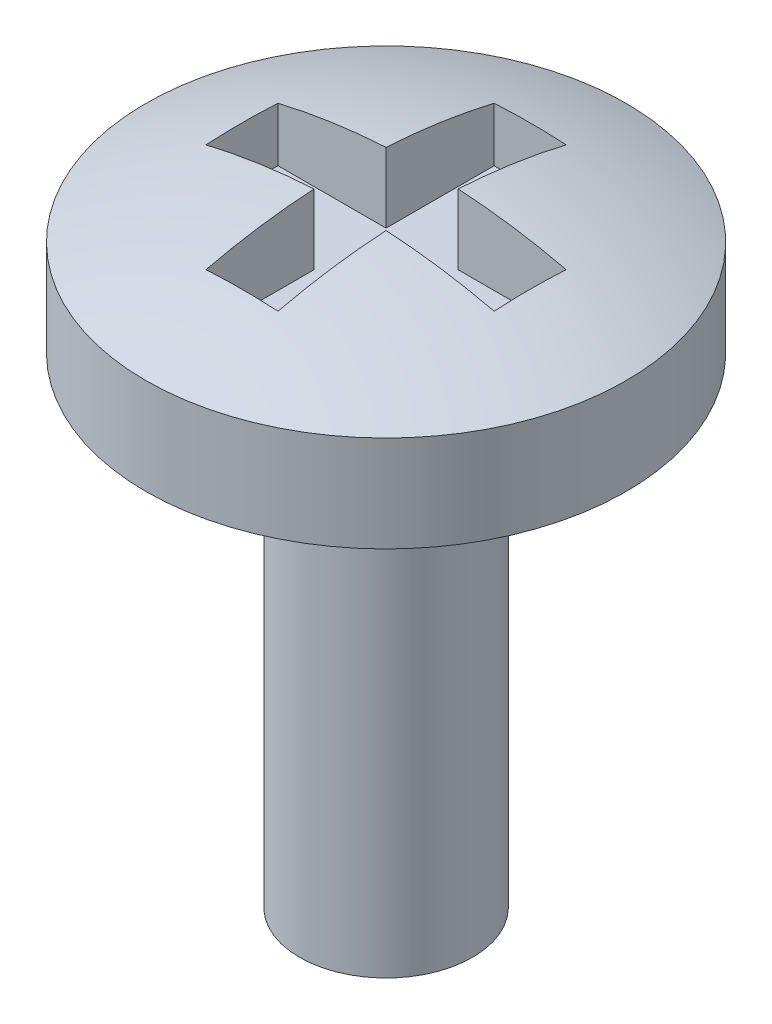
ISO-10303-21;
HEADER;
FILE_DESCRIPTION(('STEP AP214'),'2;1');
FILE_NAME('part.step','',(''),(''),'','','');
FILE_SCHEMA(('AUTOMOTIVE_DESIGN { 1 0 10303 214 1 1 1 1 }'));
ENDSEC;
DATA;
#1=APPLICATION_CONTEXT('core data for automotive mechanical design processes');
#2=APPLICATION_PROTOCOL_DEFINITION('international standard','automotive_design',2000,#1);
#3=PRODUCT_CONTEXT('',#1,'mechanical');
#4=PRODUCT('Part','Part','',(#3));
#5=PRODUCT_RELATED_PRODUCT_CATEGORY('part','',(#4));
#6=PRODUCT_DEFINITION_FORMATION('','',#4);
#7=PRODUCT_DEFINITION_CONTEXT('part definition',#1,'design');
#8=PRODUCT_DEFINITION('design','',#6,#7);
#9=PRODUCT_DEFINITION_SHAPE('','',#8);
#10=(LENGTH_UNIT() NAMED_UNIT(*) SI_UNIT(.MILLI.,.METRE.));
#11=(NAMED_UNIT(*) PLANE_ANGLE_UNIT() SI_UNIT($,.RADIAN.));
#12=(NAMED_UNIT(*) SI_UNIT($,.STERADIAN.) SOLID_ANGLE_UNIT());
#13=UNCERTAINTY_MEASURE_WITH_UNIT(LENGTH_MEASURE(1.E-05),#10,'distance_accuracy_value','');
#14=(GEOMETRIC_REPRESENTATION_CONTEXT(3) GLOBAL_UNCERTAINTY_ASSIGNED_CONTEXT((#13)) GLOBAL_UNIT_ASSIGNED_CONTEXT((#10,
#11,#12)) REPRESENTATION_CONTEXT('',''));
#15=CARTESIAN_POINT('',(0.,0.,0.));
#16=DIRECTION('',(0.,0.,1.));
#17=DIRECTION('',(1.,0.,0.));
#18=AXIS2_PLACEMENT_3D('',#15,#16,#17);
#19=CARTESIAN_POINT('',(0.,5.,0.));
#20=DIRECTION('',(0.,-1.,0.));
#21=DIRECTION('',(0.,0.,-1.));
#22=AXIS2_PLACEMENT_3D('',#19,#20,#21);
#23=CYLINDRICAL_SURFACE('',#22,0.9);
#24=CARTESIAN_POINT('',(0.,5.,0.));
#25=DIRECTION('',(0.,1.,0.));
#26=DIRECTION('',(0.,0.,1.));
#27=AXIS2_PLACEMENT_3D('',#24,#25,#26);
#28=CIRCLE('',#27,0.9);
#29=CARTESIAN_POINT('',(0.,5.,0.9));
#30=VERTEX_POINT('',#29);
#31=EDGE_CURVE('E197',#30,#30,#28,.T.);
#32=ORIENTED_EDGE('',*,*,#31,.F.);
#33=EDGE_LOOP('',(#32));
#34=FACE_BOUND('',#33,.T.);
#35=CARTESIAN_POINT('',(0.,0.,0.));
#36=DIRECTION('',(0.,1.,0.));
#37=DIRECTION('',(0.,0.,1.));
#38=AXIS2_PLACEMENT_3D('',#35,#36,#37);
#39=CIRCLE('',#38,0.9);
#40=CARTESIAN_POINT('',(0.,0.,0.9));
#41=VERTEX_POINT('',#40);
#42=EDGE_CURVE('E201',#41,#41,#39,.T.);
#43=ORIENTED_EDGE('',*,*,#42,.T.);
#44=EDGE_LOOP('',(#43));
#45=FACE_BOUND('',#44,.T.);
#46=ADVANCED_FACE('F34',(#34,#45),#23,.T.);
#47=CARTESIAN_POINT('',(0.,0.,0.));
#48=DIRECTION('',(0.,1.,0.));
#49=DIRECTION('',(0.,0.,1.));
#50=AXIS2_PLACEMENT_3D('',#47,#48,#49);
#51=PLANE('',#50);
#52=ORIENTED_EDGE('',*,*,#42,.F.);
#53=EDGE_LOOP('',(#52));
#54=FACE_BOUND('',#53,.T.);
#55=ADVANCED_FACE('F275',(#54),#51,.F.);
#56=CARTESIAN_POINT('',(0.,6.,0.));
#57=DIRECTION('',(0.,-1.,0.));
#58=DIRECTION('',(0.,0.,-1.));
#59=AXIS2_PLACEMENT_3D('',#56,#57,#58);
#60=CYLINDRICAL_SURFACE('',#59,2.5);
#61=CARTESIAN_POINT('',(0.,6.,0.));
#62=DIRECTION('',(0.,1.,0.));
#63=DIRECTION('',(0.,0.,1.));
#64=AXIS2_PLACEMENT_3D('',#61,#62,#63);
#65=CIRCLE('',#64,2.5);
#66=CARTESIAN_POINT('',(0.,6.,2.5));
#67=VERTEX_POINT('',#66);
#68=EDGE_CURVE('E196',#67,#67,#65,.T.);
#69=ORIENTED_EDGE('',*,*,#68,.F.);
#70=EDGE_LOOP('',(#69));
#71=FACE_BOUND('',#70,.T.);
#72=CARTESIAN_POINT('',(0.,5.,0.));
#73=DIRECTION('',(0.,1.,0.));
#74=DIRECTION('',(0.,0.,1.));
#75=AXIS2_PLACEMENT_3D('',#72,#73,#74);
#76=CIRCLE('',#75,2.5);
#77=CARTESIAN_POINT('',(0.,5.,2.5));
#78=VERTEX_POINT('',#77);
#79=EDGE_CURVE('E166',#78,#78,#76,.T.);
#80=ORIENTED_EDGE('',*,*,#79,.T.);
#81=EDGE_LOOP('',(#80));
#82=FACE_BOUND('',#81,.T.);
#83=ADVANCED_FACE('F280',(#71,#82),#60,.T.);
#84=CARTESIAN_POINT('',(0.,0.,0.));
#85=DIRECTION('',(0.,0.,1.));
#86=DIRECTION('',(1.,0.,0.));
#87=AXIS2_PLACEMENT_3D('',#84,#85,#86);
#88=SPHERICAL_SURFACE('',#87,6.49999999999999);
#89=CARTESIAN_POINT('',(0.,0.,0.375));
#90=DIRECTION('',(0.,0.,1.));
#91=DIRECTION('',(1.,0.,0.));
#92=AXIS2_PLACEMENT_3D('',#89,#90,#91);
#93=CIRCLE('',#92,6.4891736762087);
#94=CARTESIAN_POINT('',(-1.5,6.3134281495872,0.375));
#95=VERTEX_POINT('',#94);
#96=CARTESIAN_POINT('',(-0.375,6.47832925992497,0.375));
#97=VERTEX_POINT('',#96);
#98=EDGE_CURVE('E11',#95,#97,#93,.F.);
#99=ORIENTED_EDGE('',*,*,#98,.F.);
#100=CARTESIAN_POINT('',(-1.5,0.,0.));
#101=DIRECTION('',(-1.,0.,0.));
#102=DIRECTION('',(0.,0.,1.));
#103=AXIS2_PLACEMENT_3D('',#100,#101,#102);
#104=CIRCLE('',#103,6.32455532033675);
#105=CARTESIAN_POINT('',(-1.5,6.3134281495872,-0.375));
#106=VERTEX_POINT('',#105);
#107=EDGE_CURVE('E42',#106,#95,#104,.F.);
#108=ORIENTED_EDGE('',*,*,#107,.F.);
#109=CARTESIAN_POINT('',(0.,0.,-0.375));
#110=DIRECTION('',(0.,0.,1.));
#111=DIRECTION('',(1.,0.,0.));
#112=AXIS2_PLACEMENT_3D('',#109,#110,#111);
#113=CIRCLE('',#112,6.4891736762087);
#114=CARTESIAN_POINT('',(-0.375,6.47832925992497,-0.375));
#115=VERTEX_POINT('',#114);
#116=EDGE_CURVE('E228',#106,#115,#113,.F.);
#117=ORIENTED_EDGE('',*,*,#116,.T.);
#118=CARTESIAN_POINT('',(-0.375,0.,0.));
#119=DIRECTION('',(-1.,0.,0.));
#120=DIRECTION('',(0.,0.,1.));
#121=AXIS2_PLACEMENT_3D('',#118,#119,#120);
#122=CIRCLE('',#121,6.4891736762087);
#123=CARTESIAN_POINT('',(-0.375,6.3134281495872,-1.5));
#124=VERTEX_POINT('',#123);
#125=EDGE_CURVE('E226',#124,#115,#122,.F.);
#126=ORIENTED_EDGE('',*,*,#125,.F.);
#127=CARTESIAN_POINT('',(0.,0.,-1.5));
#128=DIRECTION('',(0.,0.,1.));
#129=DIRECTION('',(1.,0.,0.));
#130=AXIS2_PLACEMENT_3D('',#127,#128,#129);
#131=CIRCLE('',#130,6.32455532033675);
#132=CARTESIAN_POINT('',(0.375,6.3134281495872,-1.5));
#133=VERTEX_POINT('',#132);
#134=EDGE_CURVE('E223',#124,#133,#131,.F.);
#135=ORIENTED_EDGE('',*,*,#134,.T.);
#136=CARTESIAN_POINT('',(0.375,0.,0.));
#137=DIRECTION('',(-1.,0.,0.));
#138=DIRECTION('',(0.,0.,1.));
#139=AXIS2_PLACEMENT_3D('',#136,#137,#138);
#140=CIRCLE('',#139,6.4891736762087);
#141=CARTESIAN_POINT('',(0.375,6.47832925992497,-0.375));
#142=VERTEX_POINT('',#141);
#143=EDGE_CURVE('E220',#133,#142,#140,.F.);
#144=ORIENTED_EDGE('',*,*,#143,.T.);
#145=CARTESIAN_POINT('',(0.,0.,-0.375));
#146=DIRECTION('',(0.,0.,1.));
#147=DIRECTION('',(1.,0.,0.));
#148=AXIS2_PLACEMENT_3D('',#145,#146,#147);
#149=CIRCLE('',#148,6.4891736762087);
#150=CARTESIAN_POINT('',(1.5,6.3134281495872,-0.375));
#151=VERTEX_POINT('',#150);
#152=EDGE_CURVE('E217',#142,#151,#149,.F.);
#153=ORIENTED_EDGE('',*,*,#152,.T.);
#154=CARTESIAN_POINT('',(1.5,0.,0.));
#155=DIRECTION('',(-1.,0.,0.));
#156=DIRECTION('',(0.,0.,1.));
#157=AXIS2_PLACEMENT_3D('',#154,#155,#156);
#158=CIRCLE('',#157,6.32455532033675);
#159=CARTESIAN_POINT('',(1.5,6.3134281495872,0.375));
#160=VERTEX_POINT('',#159);
#161=EDGE_CURVE('E214',#151,#160,#158,.F.);
#162=ORIENTED_EDGE('',*,*,#161,.T.);
#163=CARTESIAN_POINT('',(0.,0.,0.375));
#164=DIRECTION('',(0.,0.,1.));
#165=DIRECTION('',(1.,0.,0.));
#166=AXIS2_PLACEMENT_3D('',#163,#164,#165);
#167=CIRCLE('',#166,6.4891736762087);
#168=CARTESIAN_POINT('',(0.375,6.47832925992497,0.375));
#169=VERTEX_POINT('',#168);
#170=EDGE_CURVE('E212',#169,#160,#167,.F.);
#171=ORIENTED_EDGE('',*,*,#170,.F.);
#172=CARTESIAN_POINT('',(0.375,0.,0.));
#173=DIRECTION('',(-1.,0.,0.));
#174=DIRECTION('',(0.,0.,1.));
#175=AXIS2_PLACEMENT_3D('',#172,#173,#174);
#176=CIRCLE('',#175,6.4891736762087);
#177=CARTESIAN_POINT('',(0.375,6.3134281495872,1.5));
#178=VERTEX_POINT('',#177);
#179=EDGE_CURVE('E209',#169,#178,#176,.F.);
#180=ORIENTED_EDGE('',*,*,#179,.T.);
#181=CARTESIAN_POINT('',(0.,0.,1.5));
#182=DIRECTION('',(0.,0.,1.));
#183=DIRECTION('',(1.,0.,0.));
#184=AXIS2_PLACEMENT_3D('',#181,#182,#183);
#185=CIRCLE('',#184,6.32455532033675);
#186=CARTESIAN_POINT('',(-0.375,6.3134281495872,1.5));
#187=VERTEX_POINT('',#186);
#188=EDGE_CURVE('E207',#187,#178,#185,.F.);
#189=ORIENTED_EDGE('',*,*,#188,.F.);
#190=CARTESIAN_POINT('',(-0.375,0.,0.));
#191=DIRECTION('',(-1.,0.,0.));
#192=DIRECTION('',(0.,0.,1.));
#193=AXIS2_PLACEMENT_3D('',#190,#191,#192);
#194=CIRCLE('',#193,6.4891736762087);
#195=EDGE_CURVE('E200',#97,#187,#194,.F.);
#196=ORIENTED_EDGE('',*,*,#195,.F.);
#197=EDGE_LOOP('',(#99,#108,#117,#126,#135,#144,#153,#162,#171,#180,#189,#196));
#198=FACE_BOUND('',#197,.T.);
#199=ORIENTED_EDGE('',*,*,#68,.T.);
#200=EDGE_LOOP('',(#199));
#201=FACE_BOUND('',#200,.T.);
#202=ADVANCED_FACE('F36',(#198,#201),#88,.T.);
#203=CARTESIAN_POINT('',(0.,5.,0.));
#204=DIRECTION('',(0.,1.,0.));
#205=DIRECTION('',(0.,0.,1.));
#206=AXIS2_PLACEMENT_3D('',#203,#204,#205);
#207=PLANE('',#206);
#208=ORIENTED_EDGE('',*,*,#31,.T.);
#209=EDGE_LOOP('',(#208));
#210=FACE_BOUND('',#209,.T.);
#211=ORIENTED_EDGE('',*,*,#79,.F.);
#212=EDGE_LOOP('',(#211));
#213=FACE_BOUND('',#212,.T.);
#214=ADVANCED_FACE('F289',(#210,#213),#207,.F.);
#215=CARTESIAN_POINT('',(0.,5.75,0.375));
#216=DIRECTION('',(0.,0.,1.));
#217=DIRECTION('',(1.,0.,0.));
#218=AXIS2_PLACEMENT_3D('',#215,#216,#217);
#219=PLANE('',#218);
#220=ORIENTED_EDGE('',*,*,#98,.T.);
#221=DIRECTION('',(0.,1.,0.));
#222=VECTOR('',#221,1.);
#223=CARTESIAN_POINT('',(-0.375,5.75,0.375));
#224=LINE('',#223,#222);
#225=CARTESIAN_POINT('',(-0.375,5.75,0.375));
#226=VERTEX_POINT('',#225);
#227=EDGE_CURVE('E49',#226,#97,#224,.T.);
#228=ORIENTED_EDGE('',*,*,#227,.F.);
#229=DIRECTION('',(1.,0.,0.));
#230=VECTOR('',#229,1.);
#231=CARTESIAN_POINT('',(0.,5.75,0.375));
#232=LINE('',#231,#230);
#233=CARTESIAN_POINT('',(-1.5,5.75,0.375));
#234=VERTEX_POINT('',#233);
#235=EDGE_CURVE('E123',#234,#226,#232,.T.);
#236=ORIENTED_EDGE('',*,*,#235,.F.);
#237=DIRECTION('',(0.,1.,0.));
#238=VECTOR('',#237,1.);
#239=CARTESIAN_POINT('',(-1.5,5.75,0.375));
#240=LINE('',#239,#238);
#241=EDGE_CURVE('E164',#234,#95,#240,.T.);
#242=ORIENTED_EDGE('',*,*,#241,.T.);
#243=EDGE_LOOP('',(#220,#228,#236,#242));
#244=FACE_BOUND('',#243,.T.);
#245=ADVANCED_FACE('F121',(#244),#219,.F.);
#246=CARTESIAN_POINT('',(-1.5,5.75,0.));
#247=DIRECTION('',(-1.,0.,0.));
#248=DIRECTION('',(0.,0.,1.));
#249=AXIS2_PLACEMENT_3D('',#246,#247,#248);
#250=PLANE('',#249);
#251=ORIENTED_EDGE('',*,*,#107,.T.);
#252=ORIENTED_EDGE('',*,*,#241,.F.);
#253=DIRECTION('',(0.,0.,1.));
#254=VECTOR('',#253,1.);
#255=CARTESIAN_POINT('',(-1.5,5.75,0.));
#256=LINE('',#255,#254);
#257=CARTESIAN_POINT('',(-1.5,5.75,-0.375));
#258=VERTEX_POINT('',#257);
#259=EDGE_CURVE('E128',#258,#234,#256,.T.);
#260=ORIENTED_EDGE('',*,*,#259,.F.);
#261=DIRECTION('',(0.,1.,0.));
#262=VECTOR('',#261,1.);
#263=CARTESIAN_POINT('',(-1.5,5.75,-0.375));
#264=LINE('',#263,#262);
#265=EDGE_CURVE('E167',#258,#106,#264,.T.);
#266=ORIENTED_EDGE('',*,*,#265,.T.);
#267=EDGE_LOOP('',(#251,#252,#260,#266));
#268=FACE_BOUND('',#267,.T.);
#269=ADVANCED_FACE('F236',(#268),#250,.F.);
#270=CARTESIAN_POINT('',(0.,5.75,-0.375));
#271=DIRECTION('',(0.,0.,1.));
#272=DIRECTION('',(1.,0.,0.));
#273=AXIS2_PLACEMENT_3D('',#270,#271,#272);
#274=PLANE('',#273);
#275=ORIENTED_EDGE('',*,*,#265,.F.);
#276=DIRECTION('',(1.,0.,0.));
#277=VECTOR('',#276,1.);
#278=CARTESIAN_POINT('',(0.,5.75,-0.375));
#279=LINE('',#278,#277);
#280=CARTESIAN_POINT('',(-0.375,5.75,-0.375));
#281=VERTEX_POINT('',#280);
#282=EDGE_CURVE('E161',#258,#281,#279,.T.);
#283=ORIENTED_EDGE('',*,*,#282,.T.);
#284=DIRECTION('',(0.,1.,0.));
#285=VECTOR('',#284,1.);
#286=CARTESIAN_POINT('',(-0.375,5.75,-0.375));
#287=LINE('',#286,#285);
#288=EDGE_CURVE('E169',#281,#115,#287,.T.);
#289=ORIENTED_EDGE('',*,*,#288,.T.);
#290=ORIENTED_EDGE('',*,*,#116,.F.);
#291=EDGE_LOOP('',(#275,#283,#289,#290));
#292=FACE_BOUND('',#291,.T.);
#293=ADVANCED_FACE('F234',(#292),#274,.T.);
#294=CARTESIAN_POINT('',(-0.375,5.75,0.));
#295=DIRECTION('',(-1.,0.,0.));
#296=DIRECTION('',(0.,0.,1.));
#297=AXIS2_PLACEMENT_3D('',#294,#295,#296);
#298=PLANE('',#297);
#299=ORIENTED_EDGE('',*,*,#125,.T.);
#300=ORIENTED_EDGE('',*,*,#288,.F.);
#301=DIRECTION('',(0.,0.,1.));
#302=VECTOR('',#301,1.);
#303=CARTESIAN_POINT('',(-0.375,5.75,0.));
#304=LINE('',#303,#302);
#305=CARTESIAN_POINT('',(-0.375,5.75,-1.5));
#306=VERTEX_POINT('',#305);
#307=EDGE_CURVE('E158',#306,#281,#304,.T.);
#308=ORIENTED_EDGE('',*,*,#307,.F.);
#309=DIRECTION('',(0.,1.,0.));
#310=VECTOR('',#309,1.);
#311=CARTESIAN_POINT('',(-0.375,5.75,-1.5));
#312=LINE('',#311,#310);
#313=EDGE_CURVE('E172',#306,#124,#312,.T.);
#314=ORIENTED_EDGE('',*,*,#313,.T.);
#315=EDGE_LOOP('',(#299,#300,#308,#314));
#316=FACE_BOUND('',#315,.T.);
#317=ADVANCED_FACE('F264',(#316),#298,.F.);
#318=CARTESIAN_POINT('',(0.,5.75,-1.5));
#319=DIRECTION('',(0.,0.,1.));
#320=DIRECTION('',(1.,0.,0.));
#321=AXIS2_PLACEMENT_3D('',#318,#319,#320);
#322=PLANE('',#321);
#323=ORIENTED_EDGE('',*,*,#313,.F.);
#324=DIRECTION('',(1.,0.,0.));
#325=VECTOR('',#324,1.);
#326=CARTESIAN_POINT('',(0.,5.75,-1.5));
#327=LINE('',#326,#325);
#328=CARTESIAN_POINT('',(0.375,5.75,-1.5));
#329=VERTEX_POINT('',#328);
#330=EDGE_CURVE('E156',#306,#329,#327,.T.);
#331=ORIENTED_EDGE('',*,*,#330,.T.);
#332=DIRECTION('',(0.,1.,0.));
#333=VECTOR('',#332,1.);
#334=CARTESIAN_POINT('',(0.375,5.75,-1.5));
#335=LINE('',#334,#333);
#336=EDGE_CURVE('E175',#329,#133,#335,.T.);
#337=ORIENTED_EDGE('',*,*,#336,.T.);
#338=ORIENTED_EDGE('',*,*,#134,.F.);
#339=EDGE_LOOP('',(#323,#331,#337,#338));
#340=FACE_BOUND('',#339,.T.);
#341=ADVANCED_FACE('F265',(#340),#322,.T.);
#342=CARTESIAN_POINT('',(0.375,5.75,0.));
#343=DIRECTION('',(-1.,0.,0.));
#344=DIRECTION('',(0.,0.,1.));
#345=AXIS2_PLACEMENT_3D('',#342,#343,#344);
#346=PLANE('',#345);
#347=ORIENTED_EDGE('',*,*,#336,.F.);
#348=DIRECTION('',(0.,0.,1.));
#349=VECTOR('',#348,1.);
#350=CARTESIAN_POINT('',(0.375,5.75,0.));
#351=LINE('',#350,#349);
#352=CARTESIAN_POINT('',(0.375,5.75,-0.375));
#353=VERTEX_POINT('',#352);
#354=EDGE_CURVE('E154',#329,#353,#351,.T.);
#355=ORIENTED_EDGE('',*,*,#354,.T.);
#356=DIRECTION('',(0.,1.,0.));
#357=VECTOR('',#356,1.);
#358=CARTESIAN_POINT('',(0.375,5.75,-0.375));
#359=LINE('',#358,#357);
#360=EDGE_CURVE('E178',#353,#142,#359,.T.);
#361=ORIENTED_EDGE('',*,*,#360,.T.);
#362=ORIENTED_EDGE('',*,*,#143,.F.);
#363=EDGE_LOOP('',(#347,#355,#361,#362));
#364=FACE_BOUND('',#363,.T.);
#365=ADVANCED_FACE('F258',(#364),#346,.T.);
#366=CARTESIAN_POINT('',(0.,5.75,-0.375));
#367=DIRECTION('',(0.,0.,1.));
#368=DIRECTION('',(1.,0.,0.));
#369=AXIS2_PLACEMENT_3D('',#366,#367,#368);
#370=PLANE('',#369);
#371=ORIENTED_EDGE('',*,*,#360,.F.);
#372=DIRECTION('',(1.,0.,0.));
#373=VECTOR('',#372,1.);
#374=CARTESIAN_POINT('',(0.,5.75,-0.375));
#375=LINE('',#374,#373);
#376=CARTESIAN_POINT('',(1.5,5.75,-0.375));
#377=VERTEX_POINT('',#376);
#378=EDGE_CURVE('E152',#353,#377,#375,.T.);
#379=ORIENTED_EDGE('',*,*,#378,.T.);
#380=DIRECTION('',(0.,1.,0.));
#381=VECTOR('',#380,1.);
#382=CARTESIAN_POINT('',(1.5,5.75,-0.375));
#383=LINE('',#382,#381);
#384=EDGE_CURVE('E181',#377,#151,#383,.T.);
#385=ORIENTED_EDGE('',*,*,#384,.T.);
#386=ORIENTED_EDGE('',*,*,#152,.F.);
#387=EDGE_LOOP('',(#371,#379,#385,#386));
#388=FACE_BOUND('',#387,.T.);
#389=ADVANCED_FACE('F254',(#388),#370,.T.);
#390=CARTESIAN_POINT('',(1.5,5.75,0.));
#391=DIRECTION('',(-1.,0.,0.));
#392=DIRECTION('',(0.,0.,1.));
#393=AXIS2_PLACEMENT_3D('',#390,#391,#392);
#394=PLANE('',#393);
#395=ORIENTED_EDGE('',*,*,#384,.F.);
#396=DIRECTION('',(0.,0.,1.));
#397=VECTOR('',#396,1.);
#398=CARTESIAN_POINT('',(1.5,5.75,0.));
#399=LINE('',#398,#397);
#400=CARTESIAN_POINT('',(1.5,5.75,0.375));
#401=VERTEX_POINT('',#400);
#402=EDGE_CURVE('E150',#377,#401,#399,.T.);
#403=ORIENTED_EDGE('',*,*,#402,.T.);
#404=DIRECTION('',(0.,1.,0.));
#405=VECTOR('',#404,1.);
#406=CARTESIAN_POINT('',(1.5,5.75,0.375));
#407=LINE('',#406,#405);
#408=EDGE_CURVE('E184',#401,#160,#407,.T.);
#409=ORIENTED_EDGE('',*,*,#408,.T.);
#410=ORIENTED_EDGE('',*,*,#161,.F.);
#411=EDGE_LOOP('',(#395,#403,#409,#410));
#412=FACE_BOUND('',#411,.T.);
#413=ADVANCED_FACE('F251',(#412),#394,.T.);
#414=CARTESIAN_POINT('',(0.,5.75,0.375));
#415=DIRECTION('',(0.,0.,1.));
#416=DIRECTION('',(1.,0.,0.));
#417=AXIS2_PLACEMENT_3D('',#414,#415,#416);
#418=PLANE('',#417);
#419=ORIENTED_EDGE('',*,*,#170,.T.);
#420=ORIENTED_EDGE('',*,*,#408,.F.);
#421=DIRECTION('',(1.,0.,0.));
#422=VECTOR('',#421,1.);
#423=CARTESIAN_POINT('',(0.,5.75,0.375));
#424=LINE('',#423,#422);
#425=CARTESIAN_POINT('',(0.375,5.75,0.375));
#426=VERTEX_POINT('',#425);
#427=EDGE_CURVE('E147',#426,#401,#424,.T.);
#428=ORIENTED_EDGE('',*,*,#427,.F.);
#429=DIRECTION('',(0.,1.,0.));
#430=VECTOR('',#429,1.);
#431=CARTESIAN_POINT('',(0.375,5.75,0.375));
#432=LINE('',#431,#430);
#433=EDGE_CURVE('E187',#426,#169,#432,.T.);
#434=ORIENTED_EDGE('',*,*,#433,.T.);
#435=EDGE_LOOP('',(#419,#420,#428,#434));
#436=FACE_BOUND('',#435,.T.);
#437=ADVANCED_FACE('F247',(#436),#418,.F.);
#438=CARTESIAN_POINT('',(0.375,5.75,0.));
#439=DIRECTION('',(-1.,0.,0.));
#440=DIRECTION('',(0.,0.,1.));
#441=AXIS2_PLACEMENT_3D('',#438,#439,#440);
#442=PLANE('',#441);
#443=ORIENTED_EDGE('',*,*,#433,.F.);
#444=DIRECTION('',(0.,0.,1.));
#445=VECTOR('',#444,1.);
#446=CARTESIAN_POINT('',(0.375,5.75,0.));
#447=LINE('',#446,#445);
#448=CARTESIAN_POINT('',(0.375,5.75,1.5));
#449=VERTEX_POINT('',#448);
#450=EDGE_CURVE('E145',#426,#449,#447,.T.);
#451=ORIENTED_EDGE('',*,*,#450,.T.);
#452=DIRECTION('',(0.,1.,0.));
#453=VECTOR('',#452,1.);
#454=CARTESIAN_POINT('',(0.375,5.75,1.5));
#455=LINE('',#454,#453);
#456=EDGE_CURVE('E190',#449,#178,#455,.T.);
#457=ORIENTED_EDGE('',*,*,#456,.T.);
#458=ORIENTED_EDGE('',*,*,#179,.F.);
#459=EDGE_LOOP('',(#443,#451,#457,#458));
#460=FACE_BOUND('',#459,.T.);
#461=ADVANCED_FACE('F299',(#460),#442,.T.);
#462=CARTESIAN_POINT('',(0.,5.75,1.5));
#463=DIRECTION('',(0.,0.,1.));
#464=DIRECTION('',(1.,0.,0.));
#465=AXIS2_PLACEMENT_3D('',#462,#463,#464);
#466=PLANE('',#465);
#467=ORIENTED_EDGE('',*,*,#188,.T.);
#468=ORIENTED_EDGE('',*,*,#456,.F.);
#469=DIRECTION('',(1.,0.,0.));
#470=VECTOR('',#469,1.);
#471=CARTESIAN_POINT('',(0.,5.75,1.5));
#472=LINE('',#471,#470);
#473=CARTESIAN_POINT('',(-0.375,5.75,1.5));
#474=VERTEX_POINT('',#473);
#475=EDGE_CURVE('E137',#474,#449,#472,.T.);
#476=ORIENTED_EDGE('',*,*,#475,.F.);
#477=DIRECTION('',(0.,1.,0.));
#478=VECTOR('',#477,1.);
#479=CARTESIAN_POINT('',(-0.375,5.75,1.5));
#480=LINE('',#479,#478);
#481=EDGE_CURVE('E127',#474,#187,#480,.T.);
#482=ORIENTED_EDGE('',*,*,#481,.T.);
#483=EDGE_LOOP('',(#467,#468,#476,#482));
#484=FACE_BOUND('',#483,.T.);
#485=ADVANCED_FACE('F239',(#484),#466,.F.);
#486=CARTESIAN_POINT('',(-0.375,5.75,0.));
#487=DIRECTION('',(-1.,0.,0.));
#488=DIRECTION('',(0.,0.,1.));
#489=AXIS2_PLACEMENT_3D('',#486,#487,#488);
#490=PLANE('',#489);
#491=ORIENTED_EDGE('',*,*,#195,.T.);
#492=ORIENTED_EDGE('',*,*,#481,.F.);
#493=DIRECTION('',(0.,0.,1.));
#494=VECTOR('',#493,1.);
#495=CARTESIAN_POINT('',(-0.375,5.75,0.));
#496=LINE('',#495,#494);
#497=EDGE_CURVE('E131',#226,#474,#496,.T.);
#498=ORIENTED_EDGE('',*,*,#497,.F.);
#499=ORIENTED_EDGE('',*,*,#227,.T.);
#500=EDGE_LOOP('',(#491,#492,#498,#499));
#501=FACE_BOUND('',#500,.T.);
#502=ADVANCED_FACE('F132',(#501),#490,.F.);
#503=CARTESIAN_POINT('',(0.,5.75,0.));
#504=DIRECTION('',(0.,1.,0.));
#505=DIRECTION('',(0.,0.,1.));
#506=AXIS2_PLACEMENT_3D('',#503,#504,#505);
#507=PLANE('',#506);
#508=ORIENTED_EDGE('',*,*,#235,.T.);
#509=ORIENTED_EDGE('',*,*,#497,.T.);
#510=ORIENTED_EDGE('',*,*,#475,.T.);
#511=ORIENTED_EDGE('',*,*,#450,.F.);
#512=ORIENTED_EDGE('',*,*,#427,.T.);
#513=ORIENTED_EDGE('',*,*,#402,.F.);
#514=ORIENTED_EDGE('',*,*,#378,.F.);
#515=ORIENTED_EDGE('',*,*,#354,.F.);
#516=ORIENTED_EDGE('',*,*,#330,.F.);
#517=ORIENTED_EDGE('',*,*,#307,.T.);
#518=ORIENTED_EDGE('',*,*,#282,.F.);
#519=ORIENTED_EDGE('',*,*,#259,.T.);
#520=EDGE_LOOP('',(#508,#509,#510,#511,#512,#513,#514,#515,#516,#517,#518,#519));
#521=FACE_BOUND('',#520,.T.);
#522=ADVANCED_FACE('F139',(#521),#507,.T.);
#523=CLOSED_SHELL('',(#46,#55,#83,#202,#214,#245,#269,#293,#317,#341,#365,#389,#413,#437,#461,
#485,#502,#522));
#524=MANIFOLD_SOLID_BREP('B2',#523);
#525=ADVANCED_BREP_SHAPE_REPRESENTATION('',(#18,#524),#14);
#526=SHAPE_DEFINITION_REPRESENTATION(#9,#525);
ENDSEC;
END-ISO-10303-21;
